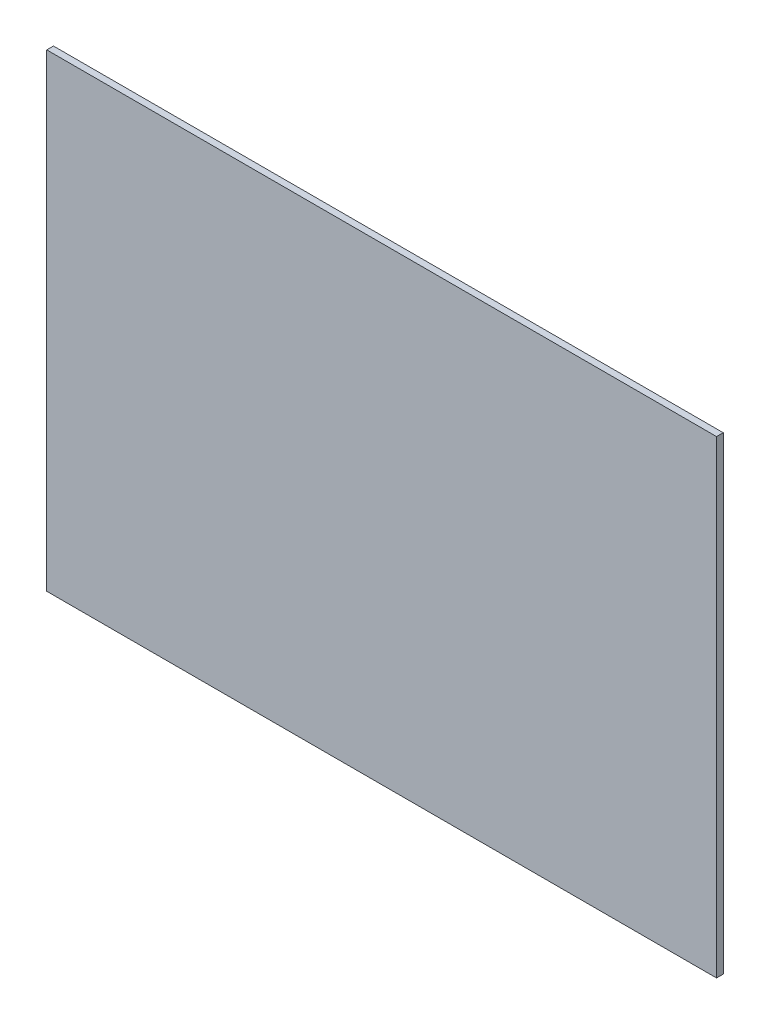
ISO-10303-21;
HEADER;
FILE_DESCRIPTION(('STEP AP214'),'2;1');
FILE_NAME('part.step','',(''),(''),'','','');
FILE_SCHEMA(('AUTOMOTIVE_DESIGN { 1 0 10303 214 1 1 1 1 }'));
ENDSEC;
DATA;
#1=APPLICATION_CONTEXT('core data for automotive mechanical design processes');
#2=APPLICATION_PROTOCOL_DEFINITION('international standard','automotive_design',2000,#1);
#3=PRODUCT_CONTEXT('',#1,'mechanical');
#4=PRODUCT('Part','Part','',(#3));
#5=PRODUCT_RELATED_PRODUCT_CATEGORY('part','',(#4));
#6=PRODUCT_DEFINITION_FORMATION('','',#4);
#7=PRODUCT_DEFINITION_CONTEXT('part definition',#1,'design');
#8=PRODUCT_DEFINITION('design','',#6,#7);
#9=PRODUCT_DEFINITION_SHAPE('','',#8);
#10=(LENGTH_UNIT() NAMED_UNIT(*) SI_UNIT(.MILLI.,.METRE.));
#11=(NAMED_UNIT(*) PLANE_ANGLE_UNIT() SI_UNIT($,.RADIAN.));
#12=(NAMED_UNIT(*) SI_UNIT($,.STERADIAN.) SOLID_ANGLE_UNIT());
#13=UNCERTAINTY_MEASURE_WITH_UNIT(LENGTH_MEASURE(1.E-05),#10,'distance_accuracy_value','');
#14=(GEOMETRIC_REPRESENTATION_CONTEXT(3) GLOBAL_UNCERTAINTY_ASSIGNED_CONTEXT((#13)) GLOBAL_UNIT_ASSIGNED_CONTEXT((#10,
#11,#12)) REPRESENTATION_CONTEXT('',''));
#15=CARTESIAN_POINT('',(0.,0.,0.));
#16=DIRECTION('',(0.,0.,1.));
#17=DIRECTION('',(1.,0.,0.));
#18=AXIS2_PLACEMENT_3D('',#15,#16,#17);
#19=CARTESIAN_POINT('',(-62.4441307758997,24.4849785407725,1.));
#20=DIRECTION('',(1.,0.,0.));
#21=DIRECTION('',(0.,1.,0.));
#22=AXIS2_PLACEMENT_3D('',#19,#20,#21);
#23=PLANE('',#22);
#24=DIRECTION('',(0.,-1.,0.));
#25=VECTOR('',#24,1.);
#26=CARTESIAN_POINT('',(-62.4441307758997,24.4849785407725,0.));
#27=LINE('',#26,#25);
#28=CARTESIAN_POINT('',(-62.4441307758997,24.4849785407725,0.));
#29=VERTEX_POINT('',#28);
#30=CARTESIAN_POINT('',(-62.4441307758997,-45.5150214592275,0.));
#31=VERTEX_POINT('',#30);
#32=EDGE_CURVE('E96',#29,#31,#27,.T.);
#33=ORIENTED_EDGE('',*,*,#32,.T.);
#34=DIRECTION('',(0.,0.,-1.));
#35=VECTOR('',#34,1.);
#36=CARTESIAN_POINT('',(-62.4441307758997,-45.5150214592275,1.));
#37=LINE('',#36,#35);
#38=CARTESIAN_POINT('',(-62.4441307758997,-45.5150214592275,1.));
#39=VERTEX_POINT('',#38);
#40=EDGE_CURVE('E11',#39,#31,#37,.T.);
#41=ORIENTED_EDGE('',*,*,#40,.F.);
#42=DIRECTION('',(0.,-1.,0.));
#43=VECTOR('',#42,1.);
#44=CARTESIAN_POINT('',(-62.4441307758997,24.4849785407725,1.));
#45=LINE('',#44,#43);
#46=CARTESIAN_POINT('',(-62.4441307758997,24.4849785407725,1.));
#47=VERTEX_POINT('',#46);
#48=EDGE_CURVE('E84',#47,#39,#45,.T.);
#49=ORIENTED_EDGE('',*,*,#48,.F.);
#50=DIRECTION('',(0.,0.,-1.));
#51=VECTOR('',#50,1.);
#52=CARTESIAN_POINT('',(-62.4441307758997,24.4849785407725,1.));
#53=LINE('',#52,#51);
#54=EDGE_CURVE('E92',#47,#29,#53,.T.);
#55=ORIENTED_EDGE('',*,*,#54,.T.);
#56=EDGE_LOOP('',(#33,#41,#49,#55));
#57=FACE_BOUND('',#56,.T.);
#58=ADVANCED_FACE('F33',(#57),#23,.F.);
#59=CARTESIAN_POINT('',(-62.4441307758997,-45.5150214592275,1.));
#60=DIRECTION('',(0.,1.,0.));
#61=DIRECTION('',(0.,0.,1.));
#62=AXIS2_PLACEMENT_3D('',#59,#60,#61);
#63=PLANE('',#62);
#64=DIRECTION('',(1.,0.,0.));
#65=VECTOR('',#64,1.);
#66=CARTESIAN_POINT('',(-62.4441307758997,-45.5150214592275,0.));
#67=LINE('',#66,#65);
#68=CARTESIAN_POINT('',(37.5558692241003,-45.5150214592275,0.));
#69=VERTEX_POINT('',#68);
#70=EDGE_CURVE('E88',#31,#69,#67,.T.);
#71=ORIENTED_EDGE('',*,*,#70,.T.);
#72=DIRECTION('',(0.,0.,-1.));
#73=VECTOR('',#72,1.);
#74=CARTESIAN_POINT('',(37.5558692241003,-45.5150214592275,1.));
#75=LINE('',#74,#73);
#76=CARTESIAN_POINT('',(37.5558692241003,-45.5150214592275,1.));
#77=VERTEX_POINT('',#76);
#78=EDGE_CURVE('E41',#77,#69,#75,.T.);
#79=ORIENTED_EDGE('',*,*,#78,.F.);
#80=DIRECTION('',(1.,0.,0.));
#81=VECTOR('',#80,1.);
#82=CARTESIAN_POINT('',(-62.4441307758997,-45.5150214592275,1.));
#83=LINE('',#82,#81);
#84=EDGE_CURVE('E79',#39,#77,#83,.T.);
#85=ORIENTED_EDGE('',*,*,#84,.F.);
#86=ORIENTED_EDGE('',*,*,#40,.T.);
#87=EDGE_LOOP('',(#71,#79,#85,#86));
#88=FACE_BOUND('',#87,.T.);
#89=ADVANCED_FACE('F87',(#88),#63,.F.);
#90=CARTESIAN_POINT('',(37.5558692241003,24.4849785407725,1.));
#91=DIRECTION('',(-1.,0.,0.));
#92=DIRECTION('',(0.,-1.,0.));
#93=AXIS2_PLACEMENT_3D('',#90,#91,#92);
#94=PLANE('',#93);
#95=DIRECTION('',(0.,1.,0.));
#96=VECTOR('',#95,1.);
#97=CARTESIAN_POINT('',(37.5558692241003,24.4849785407725,0.));
#98=LINE('',#97,#96);
#99=CARTESIAN_POINT('',(37.5558692241003,24.4849785407725,0.));
#100=VERTEX_POINT('',#99);
#101=EDGE_CURVE('E66',#69,#100,#98,.T.);
#102=ORIENTED_EDGE('',*,*,#101,.T.);
#103=DIRECTION('',(0.,0.,-1.));
#104=VECTOR('',#103,1.);
#105=CARTESIAN_POINT('',(37.5558692241003,24.4849785407725,1.));
#106=LINE('',#105,#104);
#107=CARTESIAN_POINT('',(37.5558692241003,24.4849785407725,1.));
#108=VERTEX_POINT('',#107);
#109=EDGE_CURVE('E89',#108,#100,#106,.T.);
#110=ORIENTED_EDGE('',*,*,#109,.F.);
#111=DIRECTION('',(0.,1.,0.));
#112=VECTOR('',#111,1.);
#113=CARTESIAN_POINT('',(37.5558692241003,24.4849785407725,1.));
#114=LINE('',#113,#112);
#115=EDGE_CURVE('E82',#77,#108,#114,.T.);
#116=ORIENTED_EDGE('',*,*,#115,.F.);
#117=ORIENTED_EDGE('',*,*,#78,.T.);
#118=EDGE_LOOP('',(#102,#110,#116,#117));
#119=FACE_BOUND('',#118,.T.);
#120=ADVANCED_FACE('F90',(#119),#94,.F.);
#121=CARTESIAN_POINT('',(-62.4441307758997,24.4849785407725,1.));
#122=DIRECTION('',(0.,-1.,0.));
#123=DIRECTION('',(0.,0.,-1.));
#124=AXIS2_PLACEMENT_3D('',#121,#122,#123);
#125=PLANE('',#124);
#126=DIRECTION('',(-1.,0.,0.));
#127=VECTOR('',#126,1.);
#128=CARTESIAN_POINT('',(-62.4441307758997,24.4849785407725,0.));
#129=LINE('',#128,#127);
#130=EDGE_CURVE('E72',#100,#29,#129,.T.);
#131=ORIENTED_EDGE('',*,*,#130,.T.);
#132=ORIENTED_EDGE('',*,*,#54,.F.);
#133=DIRECTION('',(-1.,0.,0.));
#134=VECTOR('',#133,1.);
#135=CARTESIAN_POINT('',(-62.4441307758997,24.4849785407725,1.));
#136=LINE('',#135,#134);
#137=EDGE_CURVE('E49',#108,#47,#136,.T.);
#138=ORIENTED_EDGE('',*,*,#137,.F.);
#139=ORIENTED_EDGE('',*,*,#109,.T.);
#140=EDGE_LOOP('',(#131,#132,#138,#139));
#141=FACE_BOUND('',#140,.T.);
#142=ADVANCED_FACE('F103',(#141),#125,.F.);
#143=CARTESIAN_POINT('',(0.,0.,1.));
#144=DIRECTION('',(0.,0.,1.));
#145=DIRECTION('',(1.,0.,0.));
#146=AXIS2_PLACEMENT_3D('',#143,#144,#145);
#147=PLANE('',#146);
#148=ORIENTED_EDGE('',*,*,#48,.T.);
#149=ORIENTED_EDGE('',*,*,#84,.T.);
#150=ORIENTED_EDGE('',*,*,#115,.T.);
#151=ORIENTED_EDGE('',*,*,#137,.T.);
#152=EDGE_LOOP('',(#148,#149,#150,#151));
#153=FACE_BOUND('',#152,.T.);
#154=ADVANCED_FACE('F80',(#153),#147,.T.);
#155=CARTESIAN_POINT('',(0.,0.,0.));
#156=DIRECTION('',(0.,0.,1.));
#157=DIRECTION('',(1.,0.,0.));
#158=AXIS2_PLACEMENT_3D('',#155,#156,#157);
#159=PLANE('',#158);
#160=ORIENTED_EDGE('',*,*,#32,.F.);
#161=ORIENTED_EDGE('',*,*,#130,.F.);
#162=ORIENTED_EDGE('',*,*,#101,.F.);
#163=ORIENTED_EDGE('',*,*,#70,.F.);
#164=EDGE_LOOP('',(#160,#161,#162,#163));
#165=FACE_BOUND('',#164,.T.);
#166=ADVANCED_FACE('F106',(#165),#159,.F.);
#167=CLOSED_SHELL('',(#58,#89,#120,#142,#154,#166));
#168=MANIFOLD_SOLID_BREP('B2',#167);
#169=ADVANCED_BREP_SHAPE_REPRESENTATION('',(#18,#168),#14);
#170=SHAPE_DEFINITION_REPRESENTATION(#9,#169);
ENDSEC;
END-ISO-10303-21;
